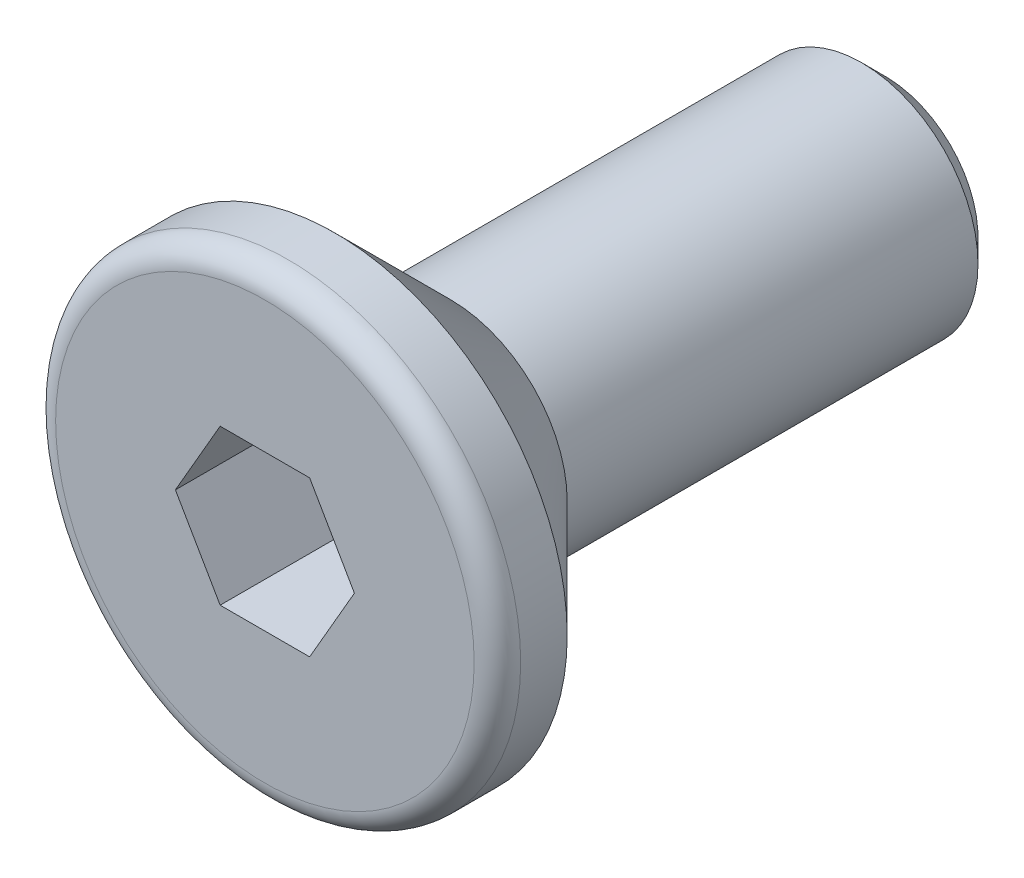
ISO-10303-21;
HEADER;
FILE_DESCRIPTION(('STEP AP214'),'2;1');
FILE_NAME('part.step','',(''),(''),'','','');
FILE_SCHEMA(('AUTOMOTIVE_DESIGN { 1 0 10303 214 1 1 1 1 }'));
ENDSEC;
DATA;
#1=APPLICATION_CONTEXT('core data for automotive mechanical design processes');
#2=APPLICATION_PROTOCOL_DEFINITION('international standard','automotive_design',2000,#1);
#3=PRODUCT_CONTEXT('',#1,'mechanical');
#4=PRODUCT('Part','Part','',(#3));
#5=PRODUCT_RELATED_PRODUCT_CATEGORY('part','',(#4));
#6=PRODUCT_DEFINITION_FORMATION('','',#4);
#7=PRODUCT_DEFINITION_CONTEXT('part definition',#1,'design');
#8=PRODUCT_DEFINITION('design','',#6,#7);
#9=PRODUCT_DEFINITION_SHAPE('','',#8);
#10=(LENGTH_UNIT() NAMED_UNIT(*) SI_UNIT(.MILLI.,.METRE.));
#11=(NAMED_UNIT(*) PLANE_ANGLE_UNIT() SI_UNIT($,.RADIAN.));
#12=(NAMED_UNIT(*) SI_UNIT($,.STERADIAN.) SOLID_ANGLE_UNIT());
#13=UNCERTAINTY_MEASURE_WITH_UNIT(LENGTH_MEASURE(1.E-05),#10,'distance_accuracy_value','');
#14=(GEOMETRIC_REPRESENTATION_CONTEXT(3) GLOBAL_UNCERTAINTY_ASSIGNED_CONTEXT((#13)) GLOBAL_UNIT_ASSIGNED_CONTEXT((#10,
#11,#12)) REPRESENTATION_CONTEXT('',''));
#15=CARTESIAN_POINT('',(0.,0.,0.));
#16=DIRECTION('',(0.,0.,1.));
#17=DIRECTION('',(1.,0.,0.));
#18=AXIS2_PLACEMENT_3D('',#15,#16,#17);
#19=CARTESIAN_POINT('',(0.,0.,4.));
#20=DIRECTION('',(0.,0.,1.));
#21=DIRECTION('',(1.,0.,0.));
#22=AXIS2_PLACEMENT_3D('',#19,#20,#21);
#23=PLANE('',#22);
#24=CARTESIAN_POINT('',(0.,0.,4.));
#25=DIRECTION('',(0.,0.,1.));
#26=DIRECTION('',(1.,0.,0.));
#27=AXIS2_PLACEMENT_3D('',#24,#25,#26);
#28=CIRCLE('',#27,2.7);
#29=CARTESIAN_POINT('',(2.7,0.,4.));
#30=VERTEX_POINT('',#29);
#31=EDGE_CURVE('E11',#30,#30,#28,.T.);
#32=ORIENTED_EDGE('',*,*,#31,.T.);
#33=EDGE_LOOP('',(#32));
#34=FACE_BOUND('',#33,.T.);
#35=DIRECTION('',(0.5,0.866025403784439,0.));
#36=VECTOR('',#35,1.);
#37=CARTESIAN_POINT('',(0.577350269189626,-1.,4.));
#38=LINE('',#37,#36);
#39=CARTESIAN_POINT('',(0.577350269189626,-1.,4.));
#40=VERTEX_POINT('',#39);
#41=CARTESIAN_POINT('',(1.15470053837925,0.,4.));
#42=VERTEX_POINT('',#41);
#43=EDGE_CURVE('E48',#40,#42,#38,.T.);
#44=ORIENTED_EDGE('',*,*,#43,.F.);
#45=DIRECTION('',(1.,0.,0.));
#46=VECTOR('',#45,1.);
#47=CARTESIAN_POINT('',(-0.577350269189626,-1.,4.));
#48=LINE('',#47,#46);
#49=CARTESIAN_POINT('',(-0.577350269189626,-1.,4.));
#50=VERTEX_POINT('',#49);
#51=EDGE_CURVE('E131',#50,#40,#48,.T.);
#52=ORIENTED_EDGE('',*,*,#51,.F.);
#53=DIRECTION('',(0.5,-0.866025403784438,0.));
#54=VECTOR('',#53,1.);
#55=CARTESIAN_POINT('',(-1.15470053837925,0.,4.));
#56=LINE('',#55,#54);
#57=CARTESIAN_POINT('',(-1.15470053837925,0.,4.));
#58=VERTEX_POINT('',#57);
#59=EDGE_CURVE('E129',#58,#50,#56,.T.);
#60=ORIENTED_EDGE('',*,*,#59,.F.);
#61=DIRECTION('',(-0.5,-0.866025403784439,0.));
#62=VECTOR('',#61,1.);
#63=CARTESIAN_POINT('',(-0.577350269189626,1.,4.));
#64=LINE('',#63,#62);
#65=CARTESIAN_POINT('',(-0.577350269189626,1.,4.));
#66=VERTEX_POINT('',#65);
#67=EDGE_CURVE('E96',#66,#58,#64,.T.);
#68=ORIENTED_EDGE('',*,*,#67,.F.);
#69=DIRECTION('',(-1.,0.,0.));
#70=VECTOR('',#69,1.);
#71=CARTESIAN_POINT('',(0.577350269189626,1.,4.));
#72=LINE('',#71,#70);
#73=CARTESIAN_POINT('',(0.577350269189626,1.,4.));
#74=VERTEX_POINT('',#73);
#75=EDGE_CURVE('E125',#74,#66,#72,.T.);
#76=ORIENTED_EDGE('',*,*,#75,.F.);
#77=DIRECTION('',(-0.5,0.866025403784438,0.));
#78=VECTOR('',#77,1.);
#79=CARTESIAN_POINT('',(1.15470053837925,0.,4.));
#80=LINE('',#79,#78);
#81=EDGE_CURVE('E122',#42,#74,#80,.T.);
#82=ORIENTED_EDGE('',*,*,#81,.F.);
#83=EDGE_LOOP('',(#44,#52,#60,#68,#76,#82));
#84=FACE_BOUND('',#83,.T.);
#85=ADVANCED_FACE('F33',(#34,#84),#23,.T.);
#86=CARTESIAN_POINT('',(0.,0.,-4.));
#87=DIRECTION('',(0.,0.,-1.));
#88=DIRECTION('',(-1.,0.,0.));
#89=AXIS2_PLACEMENT_3D('',#86,#87,#88);
#90=CYLINDRICAL_SURFACE('',#89,3.);
#91=CARTESIAN_POINT('',(0.,0.,3.7));
#92=DIRECTION('',(0.,0.,1.));
#93=DIRECTION('',(1.,0.,0.));
#94=AXIS2_PLACEMENT_3D('',#91,#92,#93);
#95=CIRCLE('',#94,3.);
#96=CARTESIAN_POINT('',(3.,0.,3.7));
#97=VERTEX_POINT('',#96);
#98=EDGE_CURVE('E41',#97,#97,#95,.F.);
#99=ORIENTED_EDGE('',*,*,#98,.T.);
#100=EDGE_LOOP('',(#99));
#101=FACE_BOUND('',#100,.T.);
#102=CARTESIAN_POINT('',(0.,0.,3.10000000000002));
#103=DIRECTION('',(0.,0.,-1.));
#104=DIRECTION('',(-1.,0.,0.));
#105=AXIS2_PLACEMENT_3D('',#102,#103,#104);
#106=CIRCLE('',#105,3.);
#107=CARTESIAN_POINT('',(-3.,0.,3.10000000000002));
#108=VERTEX_POINT('',#107);
#109=EDGE_CURVE('E149',#108,#108,#106,.T.);
#110=ORIENTED_EDGE('',*,*,#109,.F.);
#111=EDGE_LOOP('',(#110));
#112=FACE_BOUND('',#111,.T.);
#113=ADVANCED_FACE('F154',(#101,#112),#90,.T.);
#114=CARTESIAN_POINT('',(0.,0.,1.6));
#115=DIRECTION('',(0.,0.,1.));
#116=DIRECTION('',(1.,0.,0.));
#117=AXIS2_PLACEMENT_3D('',#114,#115,#116);
#118=CONICAL_SURFACE('',#117,1.5,0.785398163397443);
#119=ORIENTED_EDGE('',*,*,#109,.T.);
#120=EDGE_LOOP('',(#119));
#121=FACE_BOUND('',#120,.T.);
#122=CARTESIAN_POINT('',(0.,0.,1.6));
#123=DIRECTION('',(0.,0.,-1.));
#124=DIRECTION('',(-1.,0.,0.));
#125=AXIS2_PLACEMENT_3D('',#122,#123,#124);
#126=CIRCLE('',#125,1.5);
#127=CARTESIAN_POINT('',(-1.5,0.,1.6));
#128=VERTEX_POINT('',#127);
#129=EDGE_CURVE('E146',#128,#128,#126,.T.);
#130=ORIENTED_EDGE('',*,*,#129,.F.);
#131=EDGE_LOOP('',(#130));
#132=FACE_BOUND('',#131,.T.);
#133=ADVANCED_FACE('F171',(#121,#132),#118,.T.);
#134=CARTESIAN_POINT('',(0.,0.,-4.));
#135=DIRECTION('',(0.,0.,-1.));
#136=DIRECTION('',(-1.,0.,0.));
#137=AXIS2_PLACEMENT_3D('',#134,#135,#136);
#138=CYLINDRICAL_SURFACE('',#137,1.5);
#139=ORIENTED_EDGE('',*,*,#129,.T.);
#140=EDGE_LOOP('',(#139));
#141=FACE_BOUND('',#140,.T.);
#142=CARTESIAN_POINT('',(0.,0.,-3.7));
#143=DIRECTION('',(0.,0.,-1.));
#144=DIRECTION('',(-1.,0.,0.));
#145=AXIS2_PLACEMENT_3D('',#142,#143,#144);
#146=CIRCLE('',#145,1.5);
#147=CARTESIAN_POINT('',(-1.5,0.,-3.7));
#148=VERTEX_POINT('',#147);
#149=EDGE_CURVE('E143',#148,#148,#146,.T.);
#150=ORIENTED_EDGE('',*,*,#149,.F.);
#151=EDGE_LOOP('',(#150));
#152=FACE_BOUND('',#151,.T.);
#153=ADVANCED_FACE('F177',(#141,#152),#138,.T.);
#154=CARTESIAN_POINT('',(0.,0.,-4.));
#155=DIRECTION('',(0.,0.,1.));
#156=DIRECTION('',(1.,0.,0.));
#157=AXIS2_PLACEMENT_3D('',#154,#155,#156);
#158=CONICAL_SURFACE('',#157,1.2,0.785398163397442);
#159=ORIENTED_EDGE('',*,*,#149,.T.);
#160=EDGE_LOOP('',(#159));
#161=FACE_BOUND('',#160,.T.);
#162=CARTESIAN_POINT('',(0.,0.,-4.));
#163=DIRECTION('',(0.,0.,-1.));
#164=DIRECTION('',(-1.,0.,0.));
#165=AXIS2_PLACEMENT_3D('',#162,#163,#164);
#166=CIRCLE('',#165,1.2);
#167=CARTESIAN_POINT('',(-1.2,0.,-4.));
#168=VERTEX_POINT('',#167);
#169=EDGE_CURVE('E135',#168,#168,#166,.T.);
#170=ORIENTED_EDGE('',*,*,#169,.F.);
#171=EDGE_LOOP('',(#170));
#172=FACE_BOUND('',#171,.T.);
#173=ADVANCED_FACE('F181',(#161,#172),#158,.T.);
#174=CARTESIAN_POINT('',(0.,1.2,-4.));
#175=DIRECTION('',(0.,0.,-1.));
#176=DIRECTION('',(-1.,0.,0.));
#177=AXIS2_PLACEMENT_3D('',#174,#175,#176);
#178=PLANE('',#177);
#179=ORIENTED_EDGE('',*,*,#169,.T.);
#180=EDGE_LOOP('',(#179));
#181=FACE_BOUND('',#180,.T.);
#182=ADVANCED_FACE('F185',(#181),#178,.T.);
#183=CARTESIAN_POINT('',(0.577350269189626,-1.,2.5));
#184=DIRECTION('',(0.866025403784438,-0.5,0.));
#185=DIRECTION('',(0.5,0.866025403784439,0.));
#186=AXIS2_PLACEMENT_3D('',#183,#184,#185);
#187=PLANE('',#186);
#188=ORIENTED_EDGE('',*,*,#43,.T.);
#189=DIRECTION('',(0.,0.,1.));
#190=VECTOR('',#189,1.);
#191=CARTESIAN_POINT('',(1.15470053837925,0.,2.5));
#192=LINE('',#191,#190);
#193=CARTESIAN_POINT('',(1.15470053837925,0.,2.5));
#194=VERTEX_POINT('',#193);
#195=EDGE_CURVE('E78',#194,#42,#192,.T.);
#196=ORIENTED_EDGE('',*,*,#195,.F.);
#197=DIRECTION('',(0.5,0.866025403784439,0.));
#198=VECTOR('',#197,1.);
#199=CARTESIAN_POINT('',(0.577350269189626,-1.,2.5));
#200=LINE('',#199,#198);
#201=CARTESIAN_POINT('',(0.577350269189626,-1.,2.5));
#202=VERTEX_POINT('',#201);
#203=EDGE_CURVE('E133',#202,#194,#200,.T.);
#204=ORIENTED_EDGE('',*,*,#203,.F.);
#205=DIRECTION('',(0.,0.,1.));
#206=VECTOR('',#205,1.);
#207=CARTESIAN_POINT('',(0.577350269189626,-1.,2.5));
#208=LINE('',#207,#206);
#209=EDGE_CURVE('E56',#202,#40,#208,.T.);
#210=ORIENTED_EDGE('',*,*,#209,.T.);
#211=EDGE_LOOP('',(#188,#196,#204,#210));
#212=FACE_BOUND('',#211,.T.);
#213=ADVANCED_FACE('F189',(#212),#187,.F.);
#214=CARTESIAN_POINT('',(-0.577350269189626,-1.,2.5));
#215=DIRECTION('',(0.,-1.,0.));
#216=DIRECTION('',(1.,0.,0.));
#217=AXIS2_PLACEMENT_3D('',#214,#215,#216);
#218=PLANE('',#217);
#219=ORIENTED_EDGE('',*,*,#51,.T.);
#220=ORIENTED_EDGE('',*,*,#209,.F.);
#221=DIRECTION('',(1.,0.,0.));
#222=VECTOR('',#221,1.);
#223=CARTESIAN_POINT('',(-0.577350269189626,-1.,2.5));
#224=LINE('',#223,#222);
#225=CARTESIAN_POINT('',(-0.577350269189626,-1.,2.5));
#226=VERTEX_POINT('',#225);
#227=EDGE_CURVE('E108',#226,#202,#224,.T.);
#228=ORIENTED_EDGE('',*,*,#227,.F.);
#229=DIRECTION('',(0.,0.,1.));
#230=VECTOR('',#229,1.);
#231=CARTESIAN_POINT('',(-0.577350269189626,-1.,2.5));
#232=LINE('',#231,#230);
#233=EDGE_CURVE('E100',#226,#50,#232,.T.);
#234=ORIENTED_EDGE('',*,*,#233,.T.);
#235=EDGE_LOOP('',(#219,#220,#228,#234));
#236=FACE_BOUND('',#235,.T.);
#237=ADVANCED_FACE('F193',(#236),#218,.F.);
#238=CARTESIAN_POINT('',(-1.15470053837925,0.,2.5));
#239=DIRECTION('',(-0.866025403784439,-0.5,0.));
#240=DIRECTION('',(0.5,-0.866025403784439,0.));
#241=AXIS2_PLACEMENT_3D('',#238,#239,#240);
#242=PLANE('',#241);
#243=ORIENTED_EDGE('',*,*,#59,.T.);
#244=ORIENTED_EDGE('',*,*,#233,.F.);
#245=DIRECTION('',(0.5,-0.866025403784438,0.));
#246=VECTOR('',#245,1.);
#247=CARTESIAN_POINT('',(-1.15470053837925,0.,2.5));
#248=LINE('',#247,#246);
#249=CARTESIAN_POINT('',(-1.15470053837925,0.,2.5));
#250=VERTEX_POINT('',#249);
#251=EDGE_CURVE('E104',#250,#226,#248,.T.);
#252=ORIENTED_EDGE('',*,*,#251,.F.);
#253=DIRECTION('',(0.,0.,1.));
#254=VECTOR('',#253,1.);
#255=CARTESIAN_POINT('',(-1.15470053837925,0.,2.5));
#256=LINE('',#255,#254);
#257=EDGE_CURVE('E89',#250,#58,#256,.T.);
#258=ORIENTED_EDGE('',*,*,#257,.T.);
#259=EDGE_LOOP('',(#243,#244,#252,#258));
#260=FACE_BOUND('',#259,.T.);
#261=ADVANCED_FACE('F105',(#260),#242,.F.);
#262=CARTESIAN_POINT('',(-0.577350269189626,1.,2.5));
#263=DIRECTION('',(-0.866025403784439,0.5,0.));
#264=DIRECTION('',(-0.5,-0.866025403784439,0.));
#265=AXIS2_PLACEMENT_3D('',#262,#263,#264);
#266=PLANE('',#265);
#267=ORIENTED_EDGE('',*,*,#67,.T.);
#268=ORIENTED_EDGE('',*,*,#257,.F.);
#269=DIRECTION('',(-0.5,-0.866025403784439,0.));
#270=VECTOR('',#269,1.);
#271=CARTESIAN_POINT('',(-0.577350269189626,1.,2.5));
#272=LINE('',#271,#270);
#273=CARTESIAN_POINT('',(-0.577350269189626,1.,2.5));
#274=VERTEX_POINT('',#273);
#275=EDGE_CURVE('E93',#274,#250,#272,.T.);
#276=ORIENTED_EDGE('',*,*,#275,.F.);
#277=DIRECTION('',(0.,0.,1.));
#278=VECTOR('',#277,1.);
#279=CARTESIAN_POINT('',(-0.577350269189626,1.,2.5));
#280=LINE('',#279,#278);
#281=EDGE_CURVE('E101',#274,#66,#280,.T.);
#282=ORIENTED_EDGE('',*,*,#281,.T.);
#283=EDGE_LOOP('',(#267,#268,#276,#282));
#284=FACE_BOUND('',#283,.T.);
#285=ADVANCED_FACE('F91',(#284),#266,.F.);
#286=CARTESIAN_POINT('',(0.577350269189626,1.,2.5));
#287=DIRECTION('',(0.,1.,0.));
#288=DIRECTION('',(-1.,0.,0.));
#289=AXIS2_PLACEMENT_3D('',#286,#287,#288);
#290=PLANE('',#289);
#291=ORIENTED_EDGE('',*,*,#75,.T.);
#292=ORIENTED_EDGE('',*,*,#281,.F.);
#293=DIRECTION('',(-1.,0.,0.));
#294=VECTOR('',#293,1.);
#295=CARTESIAN_POINT('',(0.577350269189626,1.,2.5));
#296=LINE('',#295,#294);
#297=CARTESIAN_POINT('',(0.577350269189626,1.,2.5));
#298=VERTEX_POINT('',#297);
#299=EDGE_CURVE('E114',#298,#274,#296,.T.);
#300=ORIENTED_EDGE('',*,*,#299,.F.);
#301=DIRECTION('',(0.,0.,1.));
#302=VECTOR('',#301,1.);
#303=CARTESIAN_POINT('',(0.577350269189626,1.,2.5));
#304=LINE('',#303,#302);
#305=EDGE_CURVE('E138',#298,#74,#304,.T.);
#306=ORIENTED_EDGE('',*,*,#305,.T.);
#307=EDGE_LOOP('',(#291,#292,#300,#306));
#308=FACE_BOUND('',#307,.T.);
#309=ADVANCED_FACE('F196',(#308),#290,.F.);
#310=CARTESIAN_POINT('',(1.15470053837925,0.,2.5));
#311=DIRECTION('',(0.866025403784439,0.5,0.));
#312=DIRECTION('',(-0.5,0.866025403784439,0.));
#313=AXIS2_PLACEMENT_3D('',#310,#311,#312);
#314=PLANE('',#313);
#315=ORIENTED_EDGE('',*,*,#81,.T.);
#316=ORIENTED_EDGE('',*,*,#305,.F.);
#317=DIRECTION('',(-0.5,0.866025403784438,0.));
#318=VECTOR('',#317,1.);
#319=CARTESIAN_POINT('',(1.15470053837925,0.,2.5));
#320=LINE('',#319,#318);
#321=EDGE_CURVE('E116',#194,#298,#320,.T.);
#322=ORIENTED_EDGE('',*,*,#321,.F.);
#323=ORIENTED_EDGE('',*,*,#195,.T.);
#324=EDGE_LOOP('',(#315,#316,#322,#323));
#325=FACE_BOUND('',#324,.T.);
#326=ADVANCED_FACE('F162',(#325),#314,.F.);
#327=CARTESIAN_POINT('',(0.,0.,2.5));
#328=DIRECTION('',(0.,0.,1.));
#329=DIRECTION('',(1.,0.,0.));
#330=AXIS2_PLACEMENT_3D('',#327,#328,#329);
#331=PLANE('',#330);
#332=ORIENTED_EDGE('',*,*,#203,.T.);
#333=ORIENTED_EDGE('',*,*,#321,.T.);
#334=ORIENTED_EDGE('',*,*,#299,.T.);
#335=ORIENTED_EDGE('',*,*,#275,.T.);
#336=ORIENTED_EDGE('',*,*,#251,.T.);
#337=ORIENTED_EDGE('',*,*,#227,.T.);
#338=EDGE_LOOP('',(#332,#333,#334,#335,#336,#337));
#339=FACE_BOUND('',#338,.T.);
#340=ADVANCED_FACE('F111',(#339),#331,.T.);
#341=CARTESIAN_POINT('',(0.,0.,3.7));
#342=DIRECTION('',(0.,0.,1.));
#343=DIRECTION('',(1.,0.,0.));
#344=AXIS2_PLACEMENT_3D('',#341,#342,#343);
#345=TOROIDAL_SURFACE('',#344,2.7,0.3);
#346=ORIENTED_EDGE('',*,*,#31,.F.);
#347=EDGE_LOOP('',(#346));
#348=FACE_BOUND('',#347,.T.);
#349=ORIENTED_EDGE('',*,*,#98,.F.);
#350=EDGE_LOOP('',(#349));
#351=FACE_BOUND('',#350,.T.);
#352=ADVANCED_FACE('F35',(#348,#351),#345,.T.);
#353=CLOSED_SHELL('',(#85,#113,#133,#153,#173,#182,#213,#237,#261,#285,#309,#326,#340,#352));
#354=MANIFOLD_SOLID_BREP('B2',#353);
#355=ADVANCED_BREP_SHAPE_REPRESENTATION('',(#18,#354),#14);
#356=SHAPE_DEFINITION_REPRESENTATION(#9,#355);
ENDSEC;
END-ISO-10303-21;
